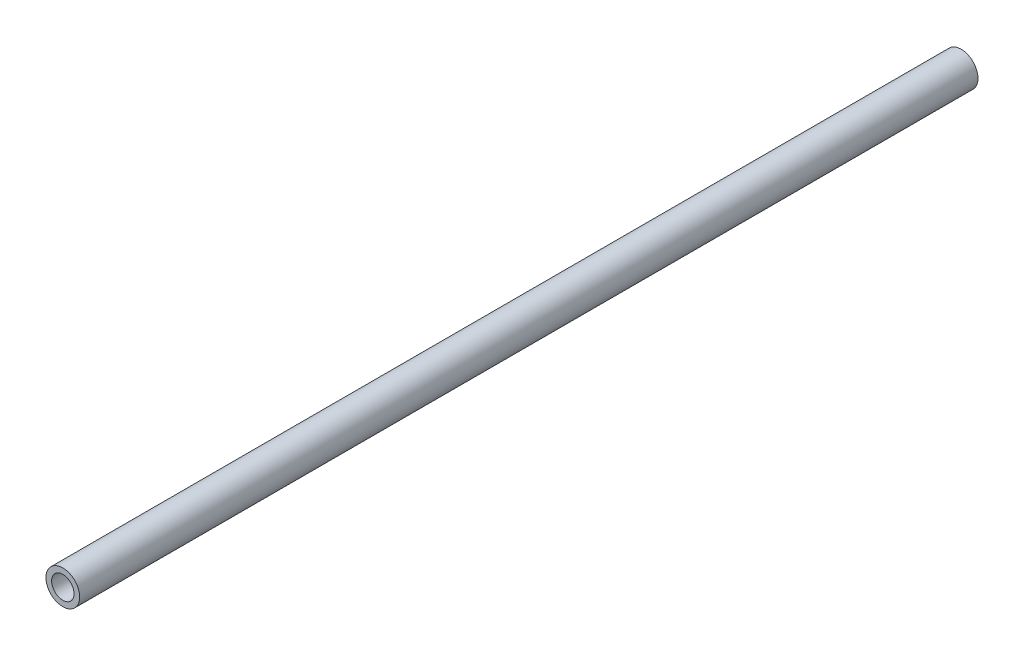
ISO-10303-21;
HEADER;
FILE_DESCRIPTION(('STEP AP214'),'2;1');
FILE_NAME('part.step','',(''),(''),'','','');
FILE_SCHEMA(('AUTOMOTIVE_DESIGN { 1 0 10303 214 1 1 1 1 }'));
ENDSEC;
DATA;
#1=APPLICATION_CONTEXT('core data for automotive mechanical design processes');
#2=APPLICATION_PROTOCOL_DEFINITION('international standard','automotive_design',2000,#1);
#3=PRODUCT_CONTEXT('',#1,'mechanical');
#4=PRODUCT('Part','Part','',(#3));
#5=PRODUCT_RELATED_PRODUCT_CATEGORY('part','',(#4));
#6=PRODUCT_DEFINITION_FORMATION('','',#4);
#7=PRODUCT_DEFINITION_CONTEXT('part definition',#1,'design');
#8=PRODUCT_DEFINITION('design','',#6,#7);
#9=PRODUCT_DEFINITION_SHAPE('','',#8);
#10=(LENGTH_UNIT() NAMED_UNIT(*) SI_UNIT(.MILLI.,.METRE.));
#11=(NAMED_UNIT(*) PLANE_ANGLE_UNIT() SI_UNIT($,.RADIAN.));
#12=(NAMED_UNIT(*) SI_UNIT($,.STERADIAN.) SOLID_ANGLE_UNIT());
#13=UNCERTAINTY_MEASURE_WITH_UNIT(LENGTH_MEASURE(1.E-05),#10,'distance_accuracy_value','');
#14=(GEOMETRIC_REPRESENTATION_CONTEXT(3) GLOBAL_UNCERTAINTY_ASSIGNED_CONTEXT((#13)) GLOBAL_UNIT_ASSIGNED_CONTEXT((#10,
#11,#12)) REPRESENTATION_CONTEXT('',''));
#15=CARTESIAN_POINT('',(0.,0.,0.));
#16=DIRECTION('',(0.,0.,1.));
#17=DIRECTION('',(1.,0.,0.));
#18=AXIS2_PLACEMENT_3D('',#15,#16,#17);
#19=CARTESIAN_POINT('',(0.,0.,406.4));
#20=DIRECTION('',(0.,0.,1.));
#21=DIRECTION('',(1.,0.,0.));
#22=AXIS2_PLACEMENT_3D('',#19,#20,#21);
#23=PLANE('',#22);
#24=CARTESIAN_POINT('',(0.,0.,406.4));
#25=DIRECTION('',(0.,0.,1.));
#26=DIRECTION('',(1.,0.,0.));
#27=AXIS2_PLACEMENT_3D('',#24,#25,#26);
#28=CIRCLE('',#27,7.62);
#29=CARTESIAN_POINT('',(7.62,0.,406.4));
#30=VERTEX_POINT('',#29);
#31=EDGE_CURVE('E10',#30,#30,#28,.T.);
#32=ORIENTED_EDGE('',*,*,#31,.T.);
#33=EDGE_LOOP('',(#32));
#34=FACE_BOUND('',#33,.T.);
#35=CARTESIAN_POINT('',(0.,0.,406.4));
#36=DIRECTION('',(0.,0.,1.));
#37=DIRECTION('',(1.,0.,0.));
#38=AXIS2_PLACEMENT_3D('',#35,#36,#37);
#39=CIRCLE('',#38,5.08);
#40=CARTESIAN_POINT('',(5.08,0.,406.4));
#41=VERTEX_POINT('',#40);
#42=EDGE_CURVE('E41',#41,#41,#39,.T.);
#43=ORIENTED_EDGE('',*,*,#42,.F.);
#44=EDGE_LOOP('',(#43));
#45=FACE_BOUND('',#44,.T.);
#46=ADVANCED_FACE('F30',(#34,#45),#23,.T.);
#47=CARTESIAN_POINT('',(0.,0.,0.));
#48=DIRECTION('',(0.,0.,1.));
#49=DIRECTION('',(1.,0.,0.));
#50=AXIS2_PLACEMENT_3D('',#47,#48,#49);
#51=PLANE('',#50);
#52=CARTESIAN_POINT('',(0.,0.,0.));
#53=DIRECTION('',(0.,0.,1.));
#54=DIRECTION('',(1.,0.,0.));
#55=AXIS2_PLACEMENT_3D('',#52,#53,#54);
#56=CIRCLE('',#55,7.62);
#57=CARTESIAN_POINT('',(7.62,0.,0.));
#58=VERTEX_POINT('',#57);
#59=EDGE_CURVE('E34',#58,#58,#56,.T.);
#60=ORIENTED_EDGE('',*,*,#59,.F.);
#61=EDGE_LOOP('',(#60));
#62=FACE_BOUND('',#61,.T.);
#63=CARTESIAN_POINT('',(0.,0.,0.));
#64=DIRECTION('',(0.,0.,1.));
#65=DIRECTION('',(1.,0.,0.));
#66=AXIS2_PLACEMENT_3D('',#63,#64,#65);
#67=CIRCLE('',#66,5.08);
#68=CARTESIAN_POINT('',(5.08,0.,0.));
#69=VERTEX_POINT('',#68);
#70=EDGE_CURVE('E43',#69,#69,#67,.T.);
#71=ORIENTED_EDGE('',*,*,#70,.T.);
#72=EDGE_LOOP('',(#71));
#73=FACE_BOUND('',#72,.T.);
#74=ADVANCED_FACE('F53',(#62,#73),#51,.F.);
#75=CARTESIAN_POINT('',(0.,0.,406.4));
#76=DIRECTION('',(0.,0.,-1.));
#77=DIRECTION('',(-1.,0.,0.));
#78=AXIS2_PLACEMENT_3D('',#75,#76,#77);
#79=CYLINDRICAL_SURFACE('',#78,7.62);
#80=ORIENTED_EDGE('',*,*,#31,.F.);
#81=EDGE_LOOP('',(#80));
#82=FACE_BOUND('',#81,.T.);
#83=ORIENTED_EDGE('',*,*,#59,.T.);
#84=EDGE_LOOP('',(#83));
#85=FACE_BOUND('',#84,.T.);
#86=ADVANCED_FACE('F32',(#82,#85),#79,.T.);
#87=CARTESIAN_POINT('',(0.,0.,406.4));
#88=DIRECTION('',(0.,0.,-1.));
#89=DIRECTION('',(-1.,0.,0.));
#90=AXIS2_PLACEMENT_3D('',#87,#88,#89);
#91=CYLINDRICAL_SURFACE('',#90,5.08);
#92=ORIENTED_EDGE('',*,*,#42,.T.);
#93=EDGE_LOOP('',(#92));
#94=FACE_BOUND('',#93,.T.);
#95=ORIENTED_EDGE('',*,*,#70,.F.);
#96=EDGE_LOOP('',(#95));
#97=FACE_BOUND('',#96,.T.);
#98=ADVANCED_FACE('F49',(#94,#97),#91,.F.);
#99=CLOSED_SHELL('',(#46,#74,#86,#98));
#100=MANIFOLD_SOLID_BREP('B2',#99);
#101=ADVANCED_BREP_SHAPE_REPRESENTATION('',(#18,#100),#14);
#102=SHAPE_DEFINITION_REPRESENTATION(#9,#101);
ENDSEC;
END-ISO-10303-21;
